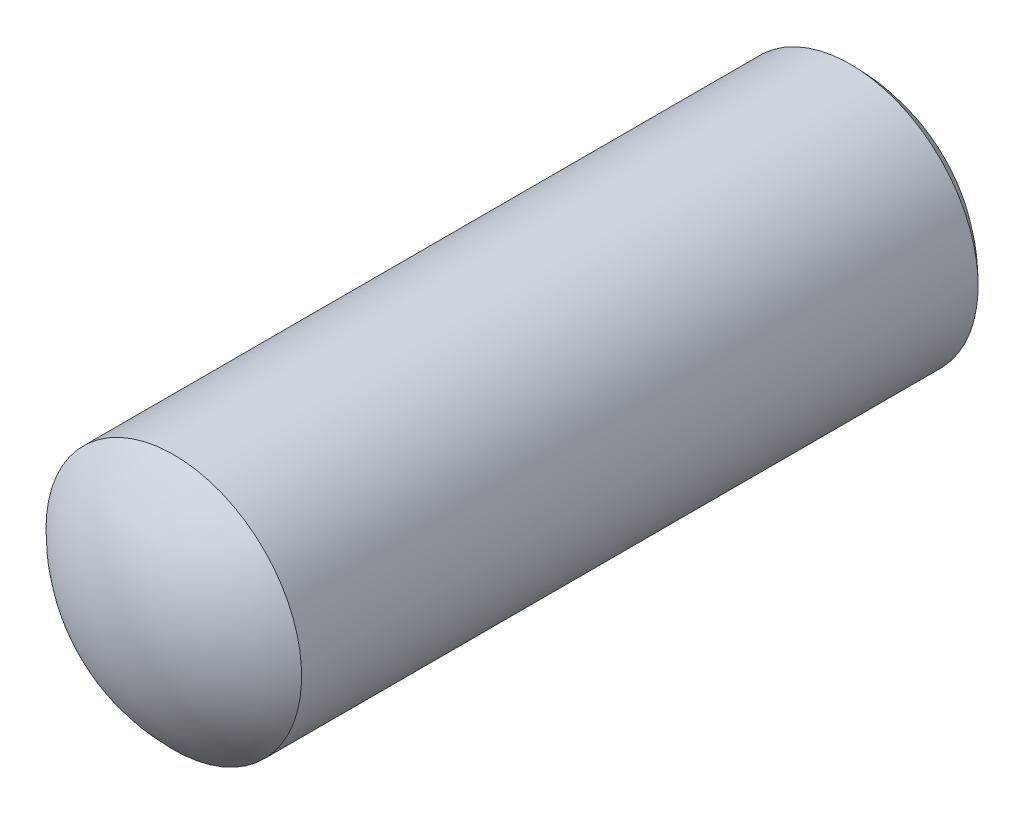
ISO-10303-21;
HEADER;
FILE_DESCRIPTION(('STEP AP214'),'2;1');
FILE_NAME('part.step','',(''),(''),'','','');
FILE_SCHEMA(('AUTOMOTIVE_DESIGN { 1 0 10303 214 1 1 1 1 }'));
ENDSEC;
DATA;
#1=APPLICATION_CONTEXT('core data for automotive mechanical design processes');
#2=APPLICATION_PROTOCOL_DEFINITION('international standard','automotive_design',2000,#1);
#3=PRODUCT_CONTEXT('',#1,'mechanical');
#4=PRODUCT('Part','Part','',(#3));
#5=PRODUCT_RELATED_PRODUCT_CATEGORY('part','',(#4));
#6=PRODUCT_DEFINITION_FORMATION('','',#4);
#7=PRODUCT_DEFINITION_CONTEXT('part definition',#1,'design');
#8=PRODUCT_DEFINITION('design','',#6,#7);
#9=PRODUCT_DEFINITION_SHAPE('','',#8);
#10=(LENGTH_UNIT() NAMED_UNIT(*) SI_UNIT(.MILLI.,.METRE.));
#11=(NAMED_UNIT(*) PLANE_ANGLE_UNIT() SI_UNIT($,.RADIAN.));
#12=(NAMED_UNIT(*) SI_UNIT($,.STERADIAN.) SOLID_ANGLE_UNIT());
#13=UNCERTAINTY_MEASURE_WITH_UNIT(LENGTH_MEASURE(1.E-05),#10,'distance_accuracy_value','');
#14=(GEOMETRIC_REPRESENTATION_CONTEXT(3) GLOBAL_UNCERTAINTY_ASSIGNED_CONTEXT((#13)) GLOBAL_UNIT_ASSIGNED_CONTEXT((#10,
#11,#12)) REPRESENTATION_CONTEXT('',''));
#15=CARTESIAN_POINT('',(0.,0.,0.));
#16=DIRECTION('',(0.,0.,1.));
#17=DIRECTION('',(1.,0.,0.));
#18=AXIS2_PLACEMENT_3D('',#15,#16,#17);
#19=CARTESIAN_POINT('',(-2.570809581178,8.75537338423227,7.875));
#20=DIRECTION('',(0.959492973614498,0.281732556841429,0.));
#21=DIRECTION('',(0.,0.,1.));
#22=AXIS2_PLACEMENT_3D('',#19,#20,#21);
#23=SPHERICAL_SURFACE('',#22,1.575);
#24=CARTESIAN_POINT('',(-2.570809581178,8.75537338423227,7.875));
#25=DIRECTION('',(0.,0.,1.));
#26=DIRECTION('',(0.28173255684143,-0.959492973614497,0.));
#27=AXIS2_PLACEMENT_3D('',#24,#25,#26);
#28=SPHERICAL_SURFACE('',#27,1.575);
#29=CARTESIAN_POINT('',(-2.570809581178,8.75537338423227,8.97727038425245));
#30=DIRECTION('',(0.,0.,1.));
#31=DIRECTION('',(0.28173255684143,-0.959492973614497,0.));
#32=AXIS2_PLACEMENT_3D('',#29,#30,#31);
#33=CIRCLE('',#32,1.125);
#34=CARTESIAN_POINT('',(-2.25386045473139,7.67594378891596,8.97727038425245));
#35=VERTEX_POINT('',#34);
#36=EDGE_CURVE('E11',#35,#35,#33,.T.);
#37=ORIENTED_EDGE('',*,*,#36,.T.);
#38=EDGE_LOOP('',(#37));
#39=FACE_BOUND('',#38,.T.);
#40=ADVANCED_FACE('F17',(#39),#28,.T.);
#41=CARTESIAN_POINT('',(-2.570809581178,8.75537338423227,6.));
#42=DIRECTION('',(0.,0.,1.));
#43=DIRECTION('',(0.28173255684143,-0.959492973614497,0.));
#44=AXIS2_PLACEMENT_3D('',#41,#42,#43);
#45=CYLINDRICAL_SURFACE('',#44,1.125);
#46=CARTESIAN_POINT('',(-2.570809581178,8.75537338423227,3.02272961574759));
#47=DIRECTION('',(0.,0.,1.));
#48=DIRECTION('',(0.28173255684143,-0.959492973614497,0.));
#49=AXIS2_PLACEMENT_3D('',#46,#47,#48);
#50=CIRCLE('',#49,1.125);
#51=CARTESIAN_POINT('',(-2.25386045473139,7.67594378891596,3.02272961574759));
#52=VERTEX_POINT('',#51);
#53=EDGE_CURVE('E26',#52,#52,#50,.T.);
#54=ORIENTED_EDGE('',*,*,#53,.T.);
#55=EDGE_LOOP('',(#54));
#56=FACE_BOUND('',#55,.T.);
#57=ORIENTED_EDGE('',*,*,#36,.F.);
#58=EDGE_LOOP('',(#57));
#59=FACE_BOUND('',#58,.T.);
#60=ADVANCED_FACE('F40',(#56,#59),#45,.T.);
#61=CARTESIAN_POINT('',(-2.570809581178,8.75537338423227,4.125));
#62=DIRECTION('',(0.959492973614497,0.28173255684143,0.));
#63=DIRECTION('',(0.,0.,-1.));
#64=AXIS2_PLACEMENT_3D('',#61,#62,#63);
#65=SPHERICAL_SURFACE('',#64,1.575);
#66=CARTESIAN_POINT('',(-2.570809581178,8.75537338423227,4.125));
#67=DIRECTION('',(0.,0.,1.));
#68=DIRECTION('',(0.28173255684143,-0.959492973614497,0.));
#69=AXIS2_PLACEMENT_3D('',#66,#67,#68);
#70=SPHERICAL_SURFACE('',#69,1.575);
#71=ORIENTED_EDGE('',*,*,#53,.F.);
#72=EDGE_LOOP('',(#71));
#73=FACE_BOUND('',#72,.T.);
#74=ADVANCED_FACE('F19',(#73),#70,.T.);
#75=CLOSED_SHELL('',(#40,#60,#74));
#76=MANIFOLD_SOLID_BREP('B1',#75);
#77=ADVANCED_BREP_SHAPE_REPRESENTATION('',(#18,#76),#14);
#78=SHAPE_DEFINITION_REPRESENTATION(#9,#77);
ENDSEC;
END-ISO-10303-21;
